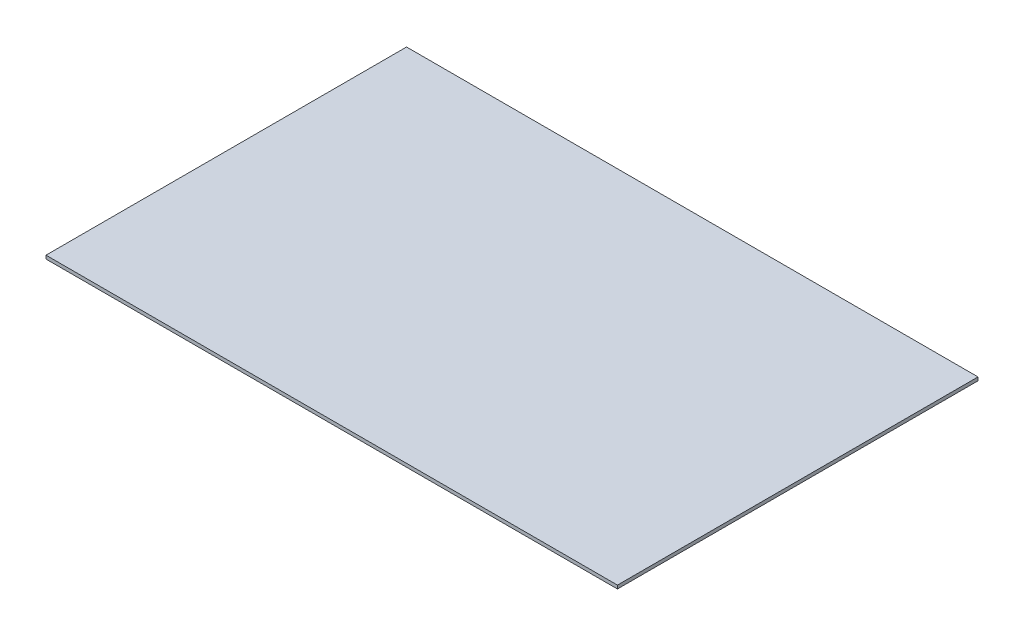
ISO-10303-21;
HEADER;
FILE_DESCRIPTION(('STEP AP214'),'2;1');
FILE_NAME('part.step','',(''),(''),'','','');
FILE_SCHEMA(('AUTOMOTIVE_DESIGN { 1 0 10303 214 1 1 1 1 }'));
ENDSEC;
DATA;
#1=APPLICATION_CONTEXT('core data for automotive mechanical design processes');
#2=APPLICATION_PROTOCOL_DEFINITION('international standard','automotive_design',2000,#1);
#3=PRODUCT_CONTEXT('',#1,'mechanical');
#4=PRODUCT('Part','Part','',(#3));
#5=PRODUCT_RELATED_PRODUCT_CATEGORY('part','',(#4));
#6=PRODUCT_DEFINITION_FORMATION('','',#4);
#7=PRODUCT_DEFINITION_CONTEXT('part definition',#1,'design');
#8=PRODUCT_DEFINITION('design','',#6,#7);
#9=PRODUCT_DEFINITION_SHAPE('','',#8);
#10=(LENGTH_UNIT() NAMED_UNIT(*) SI_UNIT(.MILLI.,.METRE.));
#11=(NAMED_UNIT(*) PLANE_ANGLE_UNIT() SI_UNIT($,.RADIAN.));
#12=(NAMED_UNIT(*) SI_UNIT($,.STERADIAN.) SOLID_ANGLE_UNIT());
#13=UNCERTAINTY_MEASURE_WITH_UNIT(LENGTH_MEASURE(1.E-05),#10,'distance_accuracy_value','');
#14=(GEOMETRIC_REPRESENTATION_CONTEXT(3) GLOBAL_UNCERTAINTY_ASSIGNED_CONTEXT((#13)) GLOBAL_UNIT_ASSIGNED_CONTEXT((#10,
#11,#12)) REPRESENTATION_CONTEXT('',''));
#15=CARTESIAN_POINT('',(0.,0.,0.));
#16=DIRECTION('',(0.,0.,1.));
#17=DIRECTION('',(1.,0.,0.));
#18=AXIS2_PLACEMENT_3D('',#15,#16,#17);
#19=CARTESIAN_POINT('',(0.,3.175,0.));
#20=DIRECTION('',(0.,0.,-1.));
#21=DIRECTION('',(-1.,0.,0.));
#22=AXIS2_PLACEMENT_3D('',#19,#20,#21);
#23=PLANE('',#22);
#24=DIRECTION('',(1.,0.,0.));
#25=VECTOR('',#24,1.);
#26=CARTESIAN_POINT('',(0.,0.,0.));
#27=LINE('',#26,#25);
#28=CARTESIAN_POINT('',(0.,0.,0.));
#29=VERTEX_POINT('',#28);
#30=CARTESIAN_POINT('',(533.4,0.,0.));
#31=VERTEX_POINT('',#30);
#32=EDGE_CURVE('E96',#29,#31,#27,.T.);
#33=ORIENTED_EDGE('',*,*,#32,.T.);
#34=DIRECTION('',(0.,-1.,0.));
#35=VECTOR('',#34,1.);
#36=CARTESIAN_POINT('',(533.4,3.175,0.));
#37=LINE('',#36,#35);
#38=CARTESIAN_POINT('',(533.4,3.175,0.));
#39=VERTEX_POINT('',#38);
#40=EDGE_CURVE('E11',#39,#31,#37,.T.);
#41=ORIENTED_EDGE('',*,*,#40,.F.);
#42=DIRECTION('',(1.,0.,0.));
#43=VECTOR('',#42,1.);
#44=CARTESIAN_POINT('',(0.,3.175,0.));
#45=LINE('',#44,#43);
#46=CARTESIAN_POINT('',(0.,3.175,0.));
#47=VERTEX_POINT('',#46);
#48=EDGE_CURVE('E83',#47,#39,#45,.T.);
#49=ORIENTED_EDGE('',*,*,#48,.F.);
#50=DIRECTION('',(0.,-1.,0.));
#51=VECTOR('',#50,1.);
#52=CARTESIAN_POINT('',(0.,3.175,0.));
#53=LINE('',#52,#51);
#54=EDGE_CURVE('E92',#47,#29,#53,.T.);
#55=ORIENTED_EDGE('',*,*,#54,.T.);
#56=EDGE_LOOP('',(#33,#41,#49,#55));
#57=FACE_BOUND('',#56,.T.);
#58=ADVANCED_FACE('F33',(#57),#23,.F.);
#59=CARTESIAN_POINT('',(533.4,3.175,0.));
#60=DIRECTION('',(-1.,0.,0.));
#61=DIRECTION('',(0.,0.,1.));
#62=AXIS2_PLACEMENT_3D('',#59,#60,#61);
#63=PLANE('',#62);
#64=DIRECTION('',(0.,0.,-1.));
#65=VECTOR('',#64,1.);
#66=CARTESIAN_POINT('',(533.4,0.,0.));
#67=LINE('',#66,#65);
#68=CARTESIAN_POINT('',(533.4,0.,-336.55));
#69=VERTEX_POINT('',#68);
#70=EDGE_CURVE('E88',#31,#69,#67,.T.);
#71=ORIENTED_EDGE('',*,*,#70,.T.);
#72=DIRECTION('',(0.,-1.,0.));
#73=VECTOR('',#72,1.);
#74=CARTESIAN_POINT('',(533.4,3.175,-336.55));
#75=LINE('',#74,#73);
#76=CARTESIAN_POINT('',(533.4,3.175,-336.55));
#77=VERTEX_POINT('',#76);
#78=EDGE_CURVE('E41',#77,#69,#75,.T.);
#79=ORIENTED_EDGE('',*,*,#78,.F.);
#80=DIRECTION('',(0.,0.,-1.));
#81=VECTOR('',#80,1.);
#82=CARTESIAN_POINT('',(533.4,3.175,0.));
#83=LINE('',#82,#81);
#84=EDGE_CURVE('E78',#39,#77,#83,.T.);
#85=ORIENTED_EDGE('',*,*,#84,.F.);
#86=ORIENTED_EDGE('',*,*,#40,.T.);
#87=EDGE_LOOP('',(#71,#79,#85,#86));
#88=FACE_BOUND('',#87,.T.);
#89=ADVANCED_FACE('F87',(#88),#63,.F.);
#90=CARTESIAN_POINT('',(0.,3.175,-336.55));
#91=DIRECTION('',(0.,0.,1.));
#92=DIRECTION('',(1.,0.,0.));
#93=AXIS2_PLACEMENT_3D('',#90,#91,#92);
#94=PLANE('',#93);
#95=DIRECTION('',(0.,-1.,0.));
#96=VECTOR('',#95,1.);
#97=CARTESIAN_POINT('',(0.,3.175,-336.55));
#98=LINE('',#97,#96);
#99=CARTESIAN_POINT('',(0.,3.175,-336.55));
#100=VERTEX_POINT('',#99);
#101=CARTESIAN_POINT('',(0.,0.,-336.55));
#102=VERTEX_POINT('',#101);
#103=EDGE_CURVE('E89',#100,#102,#98,.T.);
#104=ORIENTED_EDGE('',*,*,#103,.F.);
#105=DIRECTION('',(-1.,0.,0.));
#106=VECTOR('',#105,1.);
#107=CARTESIAN_POINT('',(349.25,3.175,-336.55));
#108=LINE('',#107,#106);
#109=EDGE_CURVE('E81',#77,#100,#108,.T.);
#110=ORIENTED_EDGE('',*,*,#109,.F.);
#111=ORIENTED_EDGE('',*,*,#78,.T.);
#112=DIRECTION('',(-1.,0.,0.));
#113=VECTOR('',#112,1.);
#114=CARTESIAN_POINT('',(0.,0.,-336.55));
#115=LINE('',#114,#113);
#116=EDGE_CURVE('E65',#69,#102,#115,.T.);
#117=ORIENTED_EDGE('',*,*,#116,.T.);
#118=EDGE_LOOP('',(#104,#110,#111,#117));
#119=FACE_BOUND('',#118,.T.);
#120=ADVANCED_FACE('F90',(#119),#94,.F.);
#121=CARTESIAN_POINT('',(0.,3.175,0.));
#122=DIRECTION('',(1.,0.,0.));
#123=DIRECTION('',(0.,0.,-1.));
#124=AXIS2_PLACEMENT_3D('',#121,#122,#123);
#125=PLANE('',#124);
#126=DIRECTION('',(0.,0.,1.));
#127=VECTOR('',#126,1.);
#128=CARTESIAN_POINT('',(0.,0.,0.));
#129=LINE('',#128,#127);
#130=EDGE_CURVE('E71',#102,#29,#129,.T.);
#131=ORIENTED_EDGE('',*,*,#130,.T.);
#132=ORIENTED_EDGE('',*,*,#54,.F.);
#133=DIRECTION('',(0.,0.,1.));
#134=VECTOR('',#133,1.);
#135=CARTESIAN_POINT('',(0.,3.175,0.));
#136=LINE('',#135,#134);
#137=EDGE_CURVE('E49',#100,#47,#136,.T.);
#138=ORIENTED_EDGE('',*,*,#137,.F.);
#139=ORIENTED_EDGE('',*,*,#103,.T.);
#140=EDGE_LOOP('',(#131,#132,#138,#139));
#141=FACE_BOUND('',#140,.T.);
#142=ADVANCED_FACE('F103',(#141),#125,.F.);
#143=CARTESIAN_POINT('',(0.,3.175,0.));
#144=DIRECTION('',(0.,1.,0.));
#145=DIRECTION('',(0.,0.,1.));
#146=AXIS2_PLACEMENT_3D('',#143,#144,#145);
#147=PLANE('',#146);
#148=ORIENTED_EDGE('',*,*,#109,.T.);
#149=ORIENTED_EDGE('',*,*,#137,.T.);
#150=ORIENTED_EDGE('',*,*,#48,.T.);
#151=ORIENTED_EDGE('',*,*,#84,.T.);
#152=EDGE_LOOP('',(#148,#149,#150,#151));
#153=FACE_BOUND('',#152,.T.);
#154=ADVANCED_FACE('F79',(#153),#147,.T.);
#155=CARTESIAN_POINT('',(0.,0.,0.));
#156=DIRECTION('',(0.,1.,0.));
#157=DIRECTION('',(0.,0.,1.));
#158=AXIS2_PLACEMENT_3D('',#155,#156,#157);
#159=PLANE('',#158);
#160=ORIENTED_EDGE('',*,*,#116,.F.);
#161=ORIENTED_EDGE('',*,*,#70,.F.);
#162=ORIENTED_EDGE('',*,*,#32,.F.);
#163=ORIENTED_EDGE('',*,*,#130,.F.);
#164=EDGE_LOOP('',(#160,#161,#162,#163));
#165=FACE_BOUND('',#164,.T.);
#166=ADVANCED_FACE('F106',(#165),#159,.F.);
#167=CLOSED_SHELL('',(#58,#89,#120,#142,#154,#166));
#168=MANIFOLD_SOLID_BREP('B2',#167);
#169=ADVANCED_BREP_SHAPE_REPRESENTATION('',(#18,#168),#14);
#170=SHAPE_DEFINITION_REPRESENTATION(#9,#169);
ENDSEC;
END-ISO-10303-21;
